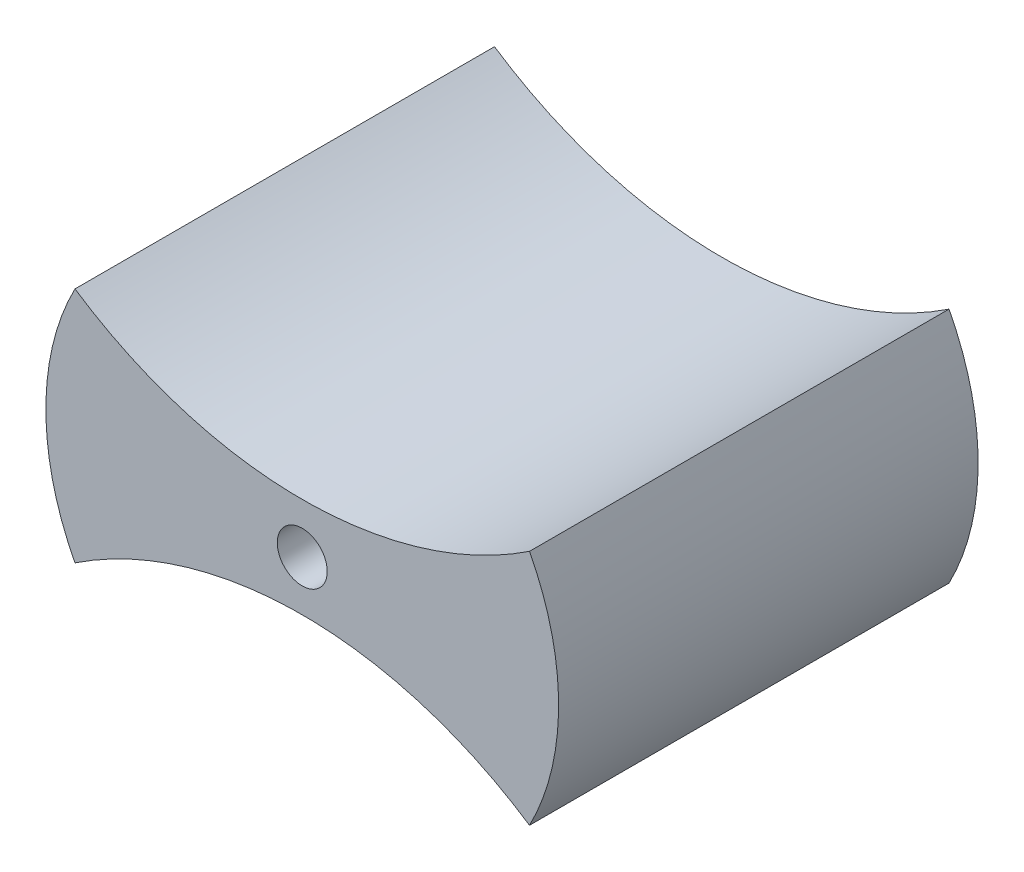
ISO-10303-21;
HEADER;
FILE_DESCRIPTION(('STEP AP214'),'2;1');
FILE_NAME('part.step','',(''),(''),'','','');
FILE_SCHEMA(('AUTOMOTIVE_DESIGN { 1 0 10303 214 1 1 1 1 }'));
ENDSEC;
DATA;
#1=APPLICATION_CONTEXT('core data for automotive mechanical design processes');
#2=APPLICATION_PROTOCOL_DEFINITION('international standard','automotive_design',2000,#1);
#3=PRODUCT_CONTEXT('',#1,'mechanical');
#4=PRODUCT('Part','Part','',(#3));
#5=PRODUCT_RELATED_PRODUCT_CATEGORY('part','',(#4));
#6=PRODUCT_DEFINITION_FORMATION('','',#4);
#7=PRODUCT_DEFINITION_CONTEXT('part definition',#1,'design');
#8=PRODUCT_DEFINITION('design','',#6,#7);
#9=PRODUCT_DEFINITION_SHAPE('','',#8);
#10=(LENGTH_UNIT() NAMED_UNIT(*) SI_UNIT(.MILLI.,.METRE.));
#11=(NAMED_UNIT(*) PLANE_ANGLE_UNIT() SI_UNIT($,.RADIAN.));
#12=(NAMED_UNIT(*) SI_UNIT($,.STERADIAN.) SOLID_ANGLE_UNIT());
#13=UNCERTAINTY_MEASURE_WITH_UNIT(LENGTH_MEASURE(1.E-05),#10,'distance_accuracy_value','');
#14=(GEOMETRIC_REPRESENTATION_CONTEXT(3) GLOBAL_UNCERTAINTY_ASSIGNED_CONTEXT((#13)) GLOBAL_UNIT_ASSIGNED_CONTEXT((#10,
#11,#12)) REPRESENTATION_CONTEXT('',''));
#15=CARTESIAN_POINT('',(0.,0.,0.));
#16=DIRECTION('',(0.,0.,1.));
#17=DIRECTION('',(1.,0.,0.));
#18=AXIS2_PLACEMENT_3D('',#15,#16,#17);
#19=CARTESIAN_POINT('',(0.,27.6455574396657,25.2));
#20=DIRECTION('',(0.,0.,-1.));
#21=DIRECTION('',(-1.,0.,0.));
#22=AXIS2_PLACEMENT_3D('',#19,#20,#21);
#23=CYLINDRICAL_SURFACE('',#22,24.6455574396657);
#24=CARTESIAN_POINT('',(0.,27.6455574396657,0.));
#25=DIRECTION('',(0.,0.,1.));
#26=DIRECTION('',(1.,0.,0.));
#27=AXIS2_PLACEMENT_3D('',#24,#25,#26);
#28=CIRCLE('',#27,24.6455574396657);
#29=CARTESIAN_POINT('',(-13.6518381431675,7.12652196465819,0.));
#30=VERTEX_POINT('',#29);
#31=CARTESIAN_POINT('',(13.6518381431675,7.12652196465819,0.));
#32=VERTEX_POINT('',#31);
#33=EDGE_CURVE('E103',#30,#32,#28,.T.);
#34=ORIENTED_EDGE('',*,*,#33,.F.);
#35=DIRECTION('',(0.,0.,-1.));
#36=VECTOR('',#35,1.);
#37=CARTESIAN_POINT('',(-13.6518381431675,7.12652196465819,25.2));
#38=LINE('',#37,#36);
#39=CARTESIAN_POINT('',(-13.6518381431675,7.12652196465819,25.2));
#40=VERTEX_POINT('',#39);
#41=EDGE_CURVE('E11',#40,#30,#38,.T.);
#42=ORIENTED_EDGE('',*,*,#41,.F.);
#43=CARTESIAN_POINT('',(0.,27.6455574396657,25.2));
#44=DIRECTION('',(0.,0.,1.));
#45=DIRECTION('',(1.,0.,0.));
#46=AXIS2_PLACEMENT_3D('',#43,#44,#45);
#47=CIRCLE('',#46,24.6455574396657);
#48=CARTESIAN_POINT('',(13.6518381431675,7.12652196465819,25.2));
#49=VERTEX_POINT('',#48);
#50=EDGE_CURVE('E85',#40,#49,#47,.T.);
#51=ORIENTED_EDGE('',*,*,#50,.T.);
#52=DIRECTION('',(0.,0.,-1.));
#53=VECTOR('',#52,1.);
#54=CARTESIAN_POINT('',(13.6518381431675,7.12652196465819,25.2));
#55=LINE('',#54,#53);
#56=EDGE_CURVE('E52',#49,#32,#55,.T.);
#57=ORIENTED_EDGE('',*,*,#56,.T.);
#58=EDGE_LOOP('',(#34,#42,#51,#57));
#59=FACE_BOUND('',#58,.T.);
#60=ADVANCED_FACE('F36',(#59),#23,.F.);
#61=CARTESIAN_POINT('',(0.,0.,25.2));
#62=DIRECTION('',(0.,0.,-1.));
#63=DIRECTION('',(-1.,0.,0.));
#64=AXIS2_PLACEMENT_3D('',#61,#62,#63);
#65=CYLINDRICAL_SURFACE('',#64,15.4);
#66=CARTESIAN_POINT('',(0.,0.,0.));
#67=DIRECTION('',(0.,0.,1.));
#68=DIRECTION('',(1.,0.,0.));
#69=AXIS2_PLACEMENT_3D('',#66,#67,#68);
#70=CIRCLE('',#69,15.4);
#71=CARTESIAN_POINT('',(-13.6518381431675,-7.12652196465819,0.));
#72=VERTEX_POINT('',#71);
#73=EDGE_CURVE('E91',#30,#72,#70,.T.);
#74=ORIENTED_EDGE('',*,*,#73,.T.);
#75=DIRECTION('',(0.,0.,-1.));
#76=VECTOR('',#75,1.);
#77=CARTESIAN_POINT('',(-13.6518381431675,-7.12652196465819,25.2));
#78=LINE('',#77,#76);
#79=CARTESIAN_POINT('',(-13.6518381431675,-7.12652196465819,25.2));
#80=VERTEX_POINT('',#79);
#81=EDGE_CURVE('E44',#80,#72,#78,.T.);
#82=ORIENTED_EDGE('',*,*,#81,.F.);
#83=CARTESIAN_POINT('',(0.,0.,25.2));
#84=DIRECTION('',(0.,0.,1.));
#85=DIRECTION('',(1.,0.,0.));
#86=AXIS2_PLACEMENT_3D('',#83,#84,#85);
#87=CIRCLE('',#86,15.4);
#88=EDGE_CURVE('E78',#40,#80,#87,.T.);
#89=ORIENTED_EDGE('',*,*,#88,.F.);
#90=ORIENTED_EDGE('',*,*,#41,.T.);
#91=EDGE_LOOP('',(#74,#82,#89,#90));
#92=FACE_BOUND('',#91,.T.);
#93=ADVANCED_FACE('F89',(#92),#65,.T.);
#94=CARTESIAN_POINT('',(0.,-27.6455574396657,25.2));
#95=DIRECTION('',(0.,0.,-1.));
#96=DIRECTION('',(-1.,0.,0.));
#97=AXIS2_PLACEMENT_3D('',#94,#95,#96);
#98=CYLINDRICAL_SURFACE('',#97,24.6455574396657);
#99=CARTESIAN_POINT('',(0.,-27.6455574396657,0.));
#100=DIRECTION('',(0.,0.,1.));
#101=DIRECTION('',(1.,0.,0.));
#102=AXIS2_PLACEMENT_3D('',#99,#100,#101);
#103=CIRCLE('',#102,24.6455574396657);
#104=CARTESIAN_POINT('',(13.6518381431675,-7.12652196465818,0.));
#105=VERTEX_POINT('',#104);
#106=EDGE_CURVE('E106',#72,#105,#103,.F.);
#107=ORIENTED_EDGE('',*,*,#106,.T.);
#108=DIRECTION('',(0.,0.,-1.));
#109=VECTOR('',#108,1.);
#110=CARTESIAN_POINT('',(13.6518381431675,-7.12652196465818,25.2));
#111=LINE('',#110,#109);
#112=CARTESIAN_POINT('',(13.6518381431675,-7.12652196465818,25.2));
#113=VERTEX_POINT('',#112);
#114=EDGE_CURVE('E66',#113,#105,#111,.T.);
#115=ORIENTED_EDGE('',*,*,#114,.F.);
#116=CARTESIAN_POINT('',(0.,-27.6455574396657,25.2));
#117=DIRECTION('',(0.,0.,1.));
#118=DIRECTION('',(1.,0.,0.));
#119=AXIS2_PLACEMENT_3D('',#116,#117,#118);
#120=CIRCLE('',#119,24.6455574396657);
#121=EDGE_CURVE('E84',#80,#113,#120,.F.);
#122=ORIENTED_EDGE('',*,*,#121,.F.);
#123=ORIENTED_EDGE('',*,*,#81,.T.);
#124=EDGE_LOOP('',(#107,#115,#122,#123));
#125=FACE_BOUND('',#124,.T.);
#126=ADVANCED_FACE('F94',(#125),#98,.F.);
#127=CARTESIAN_POINT('',(0.,0.,25.2));
#128=DIRECTION('',(0.,0.,-1.));
#129=DIRECTION('',(-1.,0.,0.));
#130=AXIS2_PLACEMENT_3D('',#127,#128,#129);
#131=CYLINDRICAL_SURFACE('',#130,15.4);
#132=CARTESIAN_POINT('',(0.,0.,0.));
#133=DIRECTION('',(0.,0.,1.));
#134=DIRECTION('',(1.,0.,0.));
#135=AXIS2_PLACEMENT_3D('',#132,#133,#134);
#136=CIRCLE('',#135,15.4);
#137=EDGE_CURVE('E108',#32,#105,#136,.F.);
#138=ORIENTED_EDGE('',*,*,#137,.F.);
#139=ORIENTED_EDGE('',*,*,#56,.F.);
#140=CARTESIAN_POINT('',(0.,0.,25.2));
#141=DIRECTION('',(0.,0.,1.));
#142=DIRECTION('',(1.,0.,0.));
#143=AXIS2_PLACEMENT_3D('',#140,#141,#142);
#144=CIRCLE('',#143,15.4);
#145=EDGE_CURVE('E95',#49,#113,#144,.F.);
#146=ORIENTED_EDGE('',*,*,#145,.T.);
#147=ORIENTED_EDGE('',*,*,#114,.T.);
#148=EDGE_LOOP('',(#138,#139,#146,#147));
#149=FACE_BOUND('',#148,.T.);
#150=ADVANCED_FACE('F117',(#149),#131,.T.);
#151=CARTESIAN_POINT('',(0.,0.,25.2));
#152=DIRECTION('',(0.,0.,-1.));
#153=DIRECTION('',(-1.,0.,0.));
#154=AXIS2_PLACEMENT_3D('',#151,#152,#153);
#155=CYLINDRICAL_SURFACE('',#154,1.5);
#156=CARTESIAN_POINT('',(0.,0.,25.2));
#157=DIRECTION('',(0.,0.,1.));
#158=DIRECTION('',(1.,0.,0.));
#159=AXIS2_PLACEMENT_3D('',#156,#157,#158);
#160=CIRCLE('',#159,1.5);
#161=CARTESIAN_POINT('',(1.5,0.,25.2));
#162=VERTEX_POINT('',#161);
#163=EDGE_CURVE('E97',#162,#162,#160,.T.);
#164=ORIENTED_EDGE('',*,*,#163,.T.);
#165=EDGE_LOOP('',(#164));
#166=FACE_BOUND('',#165,.T.);
#167=CARTESIAN_POINT('',(0.,0.,0.));
#168=DIRECTION('',(0.,0.,1.));
#169=DIRECTION('',(1.,0.,0.));
#170=AXIS2_PLACEMENT_3D('',#167,#168,#169);
#171=CIRCLE('',#170,1.5);
#172=CARTESIAN_POINT('',(1.5,0.,0.));
#173=VERTEX_POINT('',#172);
#174=EDGE_CURVE('E111',#173,#173,#171,.T.);
#175=ORIENTED_EDGE('',*,*,#174,.F.);
#176=EDGE_LOOP('',(#175));
#177=FACE_BOUND('',#176,.T.);
#178=ADVANCED_FACE('F119',(#166,#177),#155,.F.);
#179=CARTESIAN_POINT('',(0.,0.,25.2));
#180=DIRECTION('',(0.,0.,1.));
#181=DIRECTION('',(1.,0.,0.));
#182=AXIS2_PLACEMENT_3D('',#179,#180,#181);
#183=PLANE('',#182);
#184=ORIENTED_EDGE('',*,*,#50,.F.);
#185=ORIENTED_EDGE('',*,*,#88,.T.);
#186=ORIENTED_EDGE('',*,*,#121,.T.);
#187=ORIENTED_EDGE('',*,*,#145,.F.);
#188=EDGE_LOOP('',(#184,#185,#186,#187));
#189=FACE_BOUND('',#188,.T.);
#190=ORIENTED_EDGE('',*,*,#163,.F.);
#191=EDGE_LOOP('',(#190));
#192=FACE_BOUND('',#191,.T.);
#193=ADVANCED_FACE('F80',(#189,#192),#183,.T.);
#194=CARTESIAN_POINT('',(0.,0.,0.));
#195=DIRECTION('',(0.,0.,1.));
#196=DIRECTION('',(1.,0.,0.));
#197=AXIS2_PLACEMENT_3D('',#194,#195,#196);
#198=PLANE('',#197);
#199=ORIENTED_EDGE('',*,*,#33,.T.);
#200=ORIENTED_EDGE('',*,*,#137,.T.);
#201=ORIENTED_EDGE('',*,*,#106,.F.);
#202=ORIENTED_EDGE('',*,*,#73,.F.);
#203=EDGE_LOOP('',(#199,#200,#201,#202));
#204=FACE_BOUND('',#203,.T.);
#205=ORIENTED_EDGE('',*,*,#174,.T.);
#206=EDGE_LOOP('',(#205));
#207=FACE_BOUND('',#206,.T.);
#208=ADVANCED_FACE('F158',(#204,#207),#198,.F.);
#209=CLOSED_SHELL('',(#60,#93,#126,#150,#178,#193,#208));
#210=MANIFOLD_SOLID_BREP('B2',#209);
#211=ADVANCED_BREP_SHAPE_REPRESENTATION('',(#18,#210),#14);
#212=SHAPE_DEFINITION_REPRESENTATION(#9,#211);
ENDSEC;
END-ISO-10303-21;
